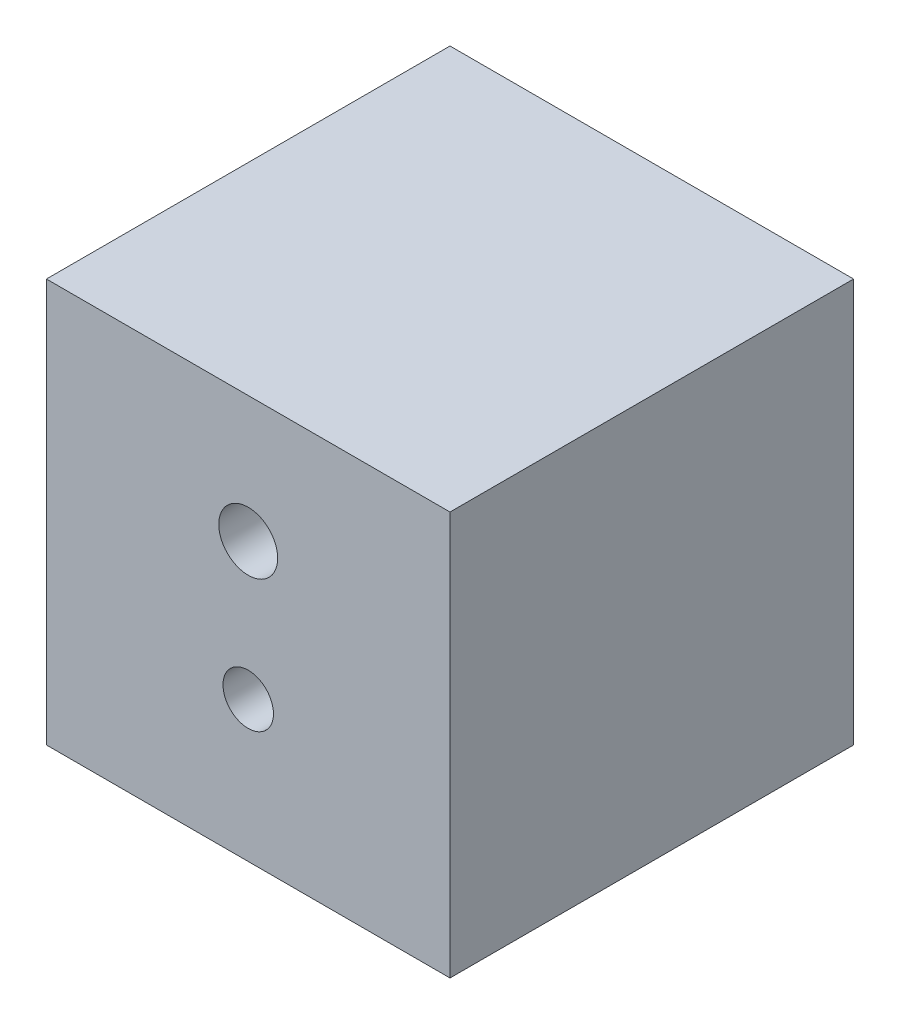
ISO-10303-21;
HEADER;
FILE_DESCRIPTION(('STEP AP214'),'2;1');
FILE_NAME('part.step','',(''),(''),'','','');
FILE_SCHEMA(('AUTOMOTIVE_DESIGN { 1 0 10303 214 1 1 1 1 }'));
ENDSEC;
DATA;
#1=APPLICATION_CONTEXT('core data for automotive mechanical design processes');
#2=APPLICATION_PROTOCOL_DEFINITION('international standard','automotive_design',2000,#1);
#3=PRODUCT_CONTEXT('',#1,'mechanical');
#4=PRODUCT('Part','Part','',(#3));
#5=PRODUCT_RELATED_PRODUCT_CATEGORY('part','',(#4));
#6=PRODUCT_DEFINITION_FORMATION('','',#4);
#7=PRODUCT_DEFINITION_CONTEXT('part definition',#1,'design');
#8=PRODUCT_DEFINITION('design','',#6,#7);
#9=PRODUCT_DEFINITION_SHAPE('','',#8);
#10=(LENGTH_UNIT() NAMED_UNIT(*) SI_UNIT(.MILLI.,.METRE.));
#11=(NAMED_UNIT(*) PLANE_ANGLE_UNIT() SI_UNIT($,.RADIAN.));
#12=(NAMED_UNIT(*) SI_UNIT($,.STERADIAN.) SOLID_ANGLE_UNIT());
#13=UNCERTAINTY_MEASURE_WITH_UNIT(LENGTH_MEASURE(1.E-05),#10,'distance_accuracy_value','');
#14=(GEOMETRIC_REPRESENTATION_CONTEXT(3) GLOBAL_UNCERTAINTY_ASSIGNED_CONTEXT((#13)) GLOBAL_UNIT_ASSIGNED_CONTEXT((#10,
#11,#12)) REPRESENTATION_CONTEXT('',''));
#15=CARTESIAN_POINT('',(0.,0.,0.));
#16=DIRECTION('',(0.,0.,1.));
#17=DIRECTION('',(1.,0.,0.));
#18=AXIS2_PLACEMENT_3D('',#15,#16,#17);
#19=CARTESIAN_POINT('',(0.,52.3670282183204,-34.29));
#20=DIRECTION('',(0.,0.,1.));
#21=DIRECTION('',(1.,0.,0.));
#22=AXIS2_PLACEMENT_3D('',#19,#20,#21);
#23=CYLINDRICAL_SURFACE('',#22,5.5626);
#24=CARTESIAN_POINT('',(0.,52.3670282183204,38.1));
#25=DIRECTION('',(0.,0.,1.));
#26=DIRECTION('',(1.,0.,0.));
#27=AXIS2_PLACEMENT_3D('',#24,#25,#26);
#28=CIRCLE('',#27,5.5626);
#29=CARTESIAN_POINT('',(5.5626,52.3670282183204,38.1));
#30=VERTEX_POINT('',#29);
#31=EDGE_CURVE('E205',#30,#30,#28,.T.);
#32=ORIENTED_EDGE('',*,*,#31,.T.);
#33=EDGE_LOOP('',(#32));
#34=FACE_BOUND('',#33,.T.);
#35=CARTESIAN_POINT('',(0.,52.3670282183204,27.94));
#36=DIRECTION('',(0.,0.,-1.));
#37=DIRECTION('',(-1.,0.,0.));
#38=AXIS2_PLACEMENT_3D('',#35,#36,#37);
#39=CIRCLE('',#38,5.5626);
#40=CARTESIAN_POINT('',(-5.5626,52.3670282183204,27.94));
#41=VERTEX_POINT('',#40);
#42=EDGE_CURVE('E12',#41,#41,#39,.F.);
#43=ORIENTED_EDGE('',*,*,#42,.F.);
#44=EDGE_LOOP('',(#43));
#45=FACE_BOUND('',#44,.T.);
#46=ADVANCED_FACE('F35',(#34,#45),#23,.F.);
#47=CARTESIAN_POINT('',(38.1,76.2,38.1));
#48=DIRECTION('',(-1.,0.,0.));
#49=DIRECTION('',(0.,0.,1.));
#50=AXIS2_PLACEMENT_3D('',#47,#48,#49);
#51=PLANE('',#50);
#52=DIRECTION('',(0.,0.,-1.));
#53=VECTOR('',#52,1.);
#54=CARTESIAN_POINT('',(38.1,0.,38.1));
#55=LINE('',#54,#53);
#56=CARTESIAN_POINT('',(38.1,0.,38.1));
#57=VERTEX_POINT('',#56);
#58=CARTESIAN_POINT('',(38.1,0.,-38.1));
#59=VERTEX_POINT('',#58);
#60=EDGE_CURVE('E102',#57,#59,#55,.T.);
#61=ORIENTED_EDGE('',*,*,#60,.T.);
#62=DIRECTION('',(0.,-1.,0.));
#63=VECTOR('',#62,1.);
#64=CARTESIAN_POINT('',(38.1,76.2,-38.1));
#65=LINE('',#64,#63);
#66=CARTESIAN_POINT('',(38.1,76.2,-38.1));
#67=VERTEX_POINT('',#66);
#68=EDGE_CURVE('E44',#67,#59,#65,.T.);
#69=ORIENTED_EDGE('',*,*,#68,.F.);
#70=DIRECTION('',(0.,0.,-1.));
#71=VECTOR('',#70,1.);
#72=CARTESIAN_POINT('',(38.1,76.2,38.1));
#73=LINE('',#72,#71);
#74=CARTESIAN_POINT('',(38.1,76.2,38.1));
#75=VERTEX_POINT('',#74);
#76=EDGE_CURVE('E88',#75,#67,#73,.T.);
#77=ORIENTED_EDGE('',*,*,#76,.F.);
#78=DIRECTION('',(0.,-1.,0.));
#79=VECTOR('',#78,1.);
#80=CARTESIAN_POINT('',(38.1,76.2,38.1));
#81=LINE('',#80,#79);
#82=EDGE_CURVE('E98',#75,#57,#81,.T.);
#83=ORIENTED_EDGE('',*,*,#82,.T.);
#84=EDGE_LOOP('',(#61,#69,#77,#83));
#85=FACE_BOUND('',#84,.T.);
#86=ADVANCED_FACE('F37',(#85),#51,.F.);
#87=CARTESIAN_POINT('',(-38.1,76.2,-38.1));
#88=DIRECTION('',(0.,0.,1.));
#89=DIRECTION('',(1.,0.,0.));
#90=AXIS2_PLACEMENT_3D('',#87,#88,#89);
#91=PLANE('',#90);
#92=DIRECTION('',(-1.,0.,0.));
#93=VECTOR('',#92,1.);
#94=CARTESIAN_POINT('',(-38.1,0.,-38.1));
#95=LINE('',#94,#93);
#96=CARTESIAN_POINT('',(-38.1,0.,-38.1));
#97=VERTEX_POINT('',#96);
#98=EDGE_CURVE('E93',#59,#97,#95,.T.);
#99=ORIENTED_EDGE('',*,*,#98,.T.);
#100=DIRECTION('',(0.,-1.,0.));
#101=VECTOR('',#100,1.);
#102=CARTESIAN_POINT('',(-38.1,76.2,-38.1));
#103=LINE('',#102,#101);
#104=CARTESIAN_POINT('',(-38.1,76.2,-38.1));
#105=VERTEX_POINT('',#104);
#106=EDGE_CURVE('E91',#105,#97,#103,.T.);
#107=ORIENTED_EDGE('',*,*,#106,.F.);
#108=DIRECTION('',(-1.,0.,0.));
#109=VECTOR('',#108,1.);
#110=CARTESIAN_POINT('',(-38.1,76.2,-38.1));
#111=LINE('',#110,#109);
#112=EDGE_CURVE('E83',#67,#105,#111,.T.);
#113=ORIENTED_EDGE('',*,*,#112,.F.);
#114=ORIENTED_EDGE('',*,*,#68,.T.);
#115=EDGE_LOOP('',(#99,#107,#113,#114));
#116=FACE_BOUND('',#115,.T.);
#117=ADVANCED_FACE('F92',(#116),#91,.F.);
#118=CARTESIAN_POINT('',(-38.1,76.2,38.1));
#119=DIRECTION('',(1.,0.,0.));
#120=DIRECTION('',(0.,0.,-1.));
#121=AXIS2_PLACEMENT_3D('',#118,#119,#120);
#122=PLANE('',#121);
#123=DIRECTION('',(0.,0.,1.));
#124=VECTOR('',#123,1.);
#125=CARTESIAN_POINT('',(-38.1,0.,38.1));
#126=LINE('',#125,#124);
#127=CARTESIAN_POINT('',(-38.1,0.,38.1));
#128=VERTEX_POINT('',#127);
#129=EDGE_CURVE('E69',#97,#128,#126,.T.);
#130=ORIENTED_EDGE('',*,*,#129,.T.);
#131=DIRECTION('',(0.,-1.,0.));
#132=VECTOR('',#131,1.);
#133=CARTESIAN_POINT('',(-38.1,76.2,38.1));
#134=LINE('',#133,#132);
#135=CARTESIAN_POINT('',(-38.1,76.2,38.1));
#136=VERTEX_POINT('',#135);
#137=EDGE_CURVE('E94',#136,#128,#134,.T.);
#138=ORIENTED_EDGE('',*,*,#137,.F.);
#139=DIRECTION('',(0.,0.,1.));
#140=VECTOR('',#139,1.);
#141=CARTESIAN_POINT('',(-38.1,76.2,38.1));
#142=LINE('',#141,#140);
#143=EDGE_CURVE('E86',#105,#136,#142,.T.);
#144=ORIENTED_EDGE('',*,*,#143,.F.);
#145=ORIENTED_EDGE('',*,*,#106,.T.);
#146=EDGE_LOOP('',(#130,#138,#144,#145));
#147=FACE_BOUND('',#146,.T.);
#148=ADVANCED_FACE('F96',(#147),#122,.F.);
#149=CARTESIAN_POINT('',(-38.1,76.2,38.1));
#150=DIRECTION('',(0.,0.,-1.));
#151=DIRECTION('',(-1.,0.,0.));
#152=AXIS2_PLACEMENT_3D('',#149,#150,#151);
#153=PLANE('',#152);
#154=CARTESIAN_POINT('',(0.,26.5225282183204,38.1));
#155=DIRECTION('',(0.,0.,1.));
#156=DIRECTION('',(1.,0.,0.));
#157=AXIS2_PLACEMENT_3D('',#154,#155,#156);
#158=CIRCLE('',#157,4.76249999999999);
#159=CARTESIAN_POINT('',(4.76249999999999,26.5225282183204,38.1));
#160=VERTEX_POINT('',#159);
#161=EDGE_CURVE('E203',#160,#160,#158,.T.);
#162=ORIENTED_EDGE('',*,*,#161,.F.);
#163=EDGE_LOOP('',(#162));
#164=FACE_BOUND('',#163,.T.);
#165=ORIENTED_EDGE('',*,*,#31,.F.);
#166=EDGE_LOOP('',(#165));
#167=FACE_BOUND('',#166,.T.);
#168=DIRECTION('',(1.,0.,0.));
#169=VECTOR('',#168,1.);
#170=CARTESIAN_POINT('',(-38.1,0.,38.1));
#171=LINE('',#170,#169);
#172=EDGE_CURVE('E75',#128,#57,#171,.T.);
#173=ORIENTED_EDGE('',*,*,#172,.T.);
#174=ORIENTED_EDGE('',*,*,#82,.F.);
#175=DIRECTION('',(1.,0.,0.));
#176=VECTOR('',#175,1.);
#177=CARTESIAN_POINT('',(-38.1,76.2,38.1));
#178=LINE('',#177,#176);
#179=EDGE_CURVE('E52',#136,#75,#178,.T.);
#180=ORIENTED_EDGE('',*,*,#179,.F.);
#181=ORIENTED_EDGE('',*,*,#137,.T.);
#182=EDGE_LOOP('',(#173,#174,#180,#181));
#183=FACE_BOUND('',#182,.T.);
#184=ADVANCED_FACE('F124',(#164,#167,#183),#153,.F.);
#185=CARTESIAN_POINT('',(0.,76.2,0.));
#186=DIRECTION('',(0.,-1.,0.));
#187=DIRECTION('',(0.,0.,-1.));
#188=AXIS2_PLACEMENT_3D('',#185,#186,#187);
#189=PLANE('',#188);
#190=ORIENTED_EDGE('',*,*,#76,.T.);
#191=ORIENTED_EDGE('',*,*,#112,.T.);
#192=ORIENTED_EDGE('',*,*,#143,.T.);
#193=ORIENTED_EDGE('',*,*,#179,.T.);
#194=EDGE_LOOP('',(#190,#191,#192,#193));
#195=FACE_BOUND('',#194,.T.);
#196=ADVANCED_FACE('F84',(#195),#189,.F.);
#197=CARTESIAN_POINT('',(0.,0.,0.));
#198=DIRECTION('',(0.,-1.,0.));
#199=DIRECTION('',(0.,0.,-1.));
#200=AXIS2_PLACEMENT_3D('',#197,#198,#199);
#201=PLANE('',#200);
#202=ORIENTED_EDGE('',*,*,#60,.F.);
#203=ORIENTED_EDGE('',*,*,#172,.F.);
#204=ORIENTED_EDGE('',*,*,#129,.F.);
#205=ORIENTED_EDGE('',*,*,#98,.F.);
#206=EDGE_LOOP('',(#202,#203,#204,#205));
#207=FACE_BOUND('',#206,.T.);
#208=ADVANCED_FACE('F113',(#207),#201,.T.);
#209=CARTESIAN_POINT('',(0.,26.5225282183204,-34.29));
#210=DIRECTION('',(0.,0.,1.));
#211=DIRECTION('',(1.,0.,0.));
#212=AXIS2_PLACEMENT_3D('',#209,#210,#211);
#213=CYLINDRICAL_SURFACE('',#212,4.76249999999999);
#214=CARTESIAN_POINT('',(0.,26.5225282183204,-34.29));
#215=DIRECTION('',(0.,0.,1.));
#216=DIRECTION('',(1.,0.,0.));
#217=AXIS2_PLACEMENT_3D('',#214,#215,#216);
#218=CIRCLE('',#217,4.76249999999999);
#219=CARTESIAN_POINT('',(4.76249999999999,26.5225282183204,-34.29));
#220=VERTEX_POINT('',#219);
#221=EDGE_CURVE('E105',#220,#220,#218,.T.);
#222=ORIENTED_EDGE('',*,*,#221,.F.);
#223=EDGE_LOOP('',(#222));
#224=FACE_BOUND('',#223,.T.);
#225=ORIENTED_EDGE('',*,*,#161,.T.);
#226=EDGE_LOOP('',(#225));
#227=FACE_BOUND('',#226,.T.);
#228=ADVANCED_FACE('F115',(#224,#227),#213,.F.);
#229=CARTESIAN_POINT('',(0.,26.5225282183204,-34.29));
#230=DIRECTION('',(0.,0.,1.));
#231=DIRECTION('',(1.,0.,0.));
#232=AXIS2_PLACEMENT_3D('',#229,#230,#231);
#233=PLANE('',#232);
#234=ORIENTED_EDGE('',*,*,#221,.T.);
#235=EDGE_LOOP('',(#234));
#236=FACE_BOUND('',#235,.T.);
#237=ADVANCED_FACE('F121',(#236),#233,.T.);
#238=CARTESIAN_POINT('',(-38.1,76.2,27.94));
#239=DIRECTION('',(0.,0.,-1.));
#240=DIRECTION('',(-1.,0.,0.));
#241=AXIS2_PLACEMENT_3D('',#238,#239,#240);
#242=PLANE('',#241);
#243=ORIENTED_EDGE('',*,*,#42,.T.);
#244=EDGE_LOOP('',(#243));
#245=FACE_BOUND('',#244,.T.);
#246=ADVANCED_FACE('F140',(#245),#242,.F.);
#247=CLOSED_SHELL('',(#46,#86,#117,#148,#184,#196,#208,#228,#237,#246));
#248=MANIFOLD_SOLID_BREP('B2',#247);
#249=ADVANCED_BREP_SHAPE_REPRESENTATION('',(#18,#248),#14);
#250=SHAPE_DEFINITION_REPRESENTATION(#9,#249);
ENDSEC;
END-ISO-10303-21;
